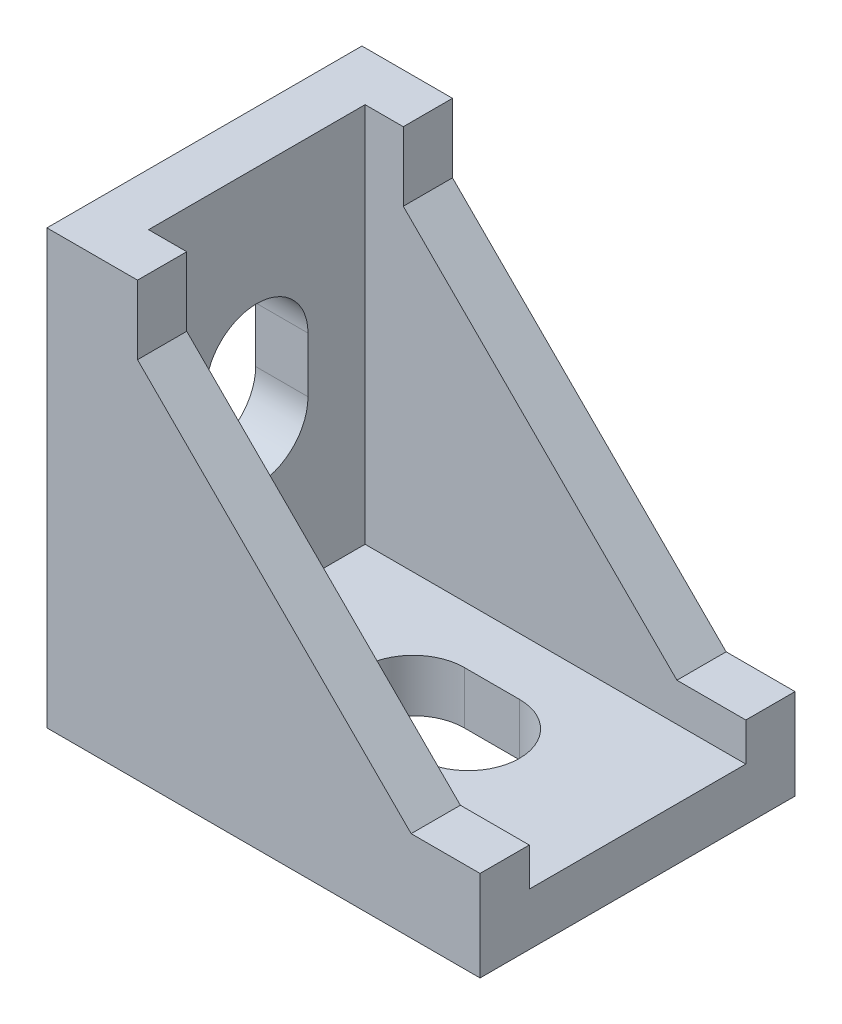
ISO-10303-21;
HEADER;
FILE_DESCRIPTION(('STEP AP214'),'2;1');
FILE_NAME('part.step','',(''),(''),'','','');
FILE_SCHEMA(('AUTOMOTIVE_DESIGN { 1 0 10303 214 1 1 1 1 }'));
ENDSEC;
DATA;
#1=APPLICATION_CONTEXT('core data for automotive mechanical design processes');
#2=APPLICATION_PROTOCOL_DEFINITION('international standard','automotive_design',2000,#1);
#3=PRODUCT_CONTEXT('',#1,'mechanical');
#4=PRODUCT('Part','Part','',(#3));
#5=PRODUCT_RELATED_PRODUCT_CATEGORY('part','',(#4));
#6=PRODUCT_DEFINITION_FORMATION('','',#4);
#7=PRODUCT_DEFINITION_CONTEXT('part definition',#1,'design');
#8=PRODUCT_DEFINITION('design','',#6,#7);
#9=PRODUCT_DEFINITION_SHAPE('','',#8);
#10=(LENGTH_UNIT() NAMED_UNIT(*) SI_UNIT(.MILLI.,.METRE.));
#11=(NAMED_UNIT(*) PLANE_ANGLE_UNIT() SI_UNIT($,.RADIAN.));
#12=(NAMED_UNIT(*) SI_UNIT($,.STERADIAN.) SOLID_ANGLE_UNIT());
#13=UNCERTAINTY_MEASURE_WITH_UNIT(LENGTH_MEASURE(1.E-05),#10,'distance_accuracy_value','');
#14=(GEOMETRIC_REPRESENTATION_CONTEXT(3) GLOBAL_UNCERTAINTY_ASSIGNED_CONTEXT((#13)) GLOBAL_UNIT_ASSIGNED_CONTEXT((#10,
#11,#12)) REPRESENTATION_CONTEXT('',''));
#15=CARTESIAN_POINT('',(0.,0.,0.));
#16=DIRECTION('',(0.,0.,1.));
#17=DIRECTION('',(1.,0.,0.));
#18=AXIS2_PLACEMENT_3D('',#15,#16,#17);
#19=CARTESIAN_POINT('',(5.842,27.94,-20.32));
#20=DIRECTION('',(1.,0.,0.));
#21=DIRECTION('',(0.,1.,0.));
#22=AXIS2_PLACEMENT_3D('',#19,#20,#21);
#23=PLANE('',#22);
#24=DIRECTION('',(0.,-1.,0.));
#25=VECTOR('',#24,1.);
#26=CARTESIAN_POINT('',(5.842,27.94,-3.175));
#27=LINE('',#26,#25);
#28=CARTESIAN_POINT('',(5.842,27.94,-3.175));
#29=VERTEX_POINT('',#28);
#30=CARTESIAN_POINT('',(5.842,23.495,-3.175));
#31=VERTEX_POINT('',#30);
#32=EDGE_CURVE('E277',#29,#31,#27,.T.);
#33=ORIENTED_EDGE('',*,*,#32,.F.);
#34=DIRECTION('',(0.,0.,1.));
#35=VECTOR('',#34,1.);
#36=CARTESIAN_POINT('',(5.842,27.94,-20.32));
#37=LINE('',#36,#35);
#38=CARTESIAN_POINT('',(5.842,27.94,0.));
#39=VERTEX_POINT('',#38);
#40=EDGE_CURVE('E238',#29,#39,#37,.T.);
#41=ORIENTED_EDGE('',*,*,#40,.T.);
#42=DIRECTION('',(0.,1.,0.));
#43=VECTOR('',#42,1.);
#44=CARTESIAN_POINT('',(5.842,27.94,0.));
#45=LINE('',#44,#43);
#46=CARTESIAN_POINT('',(5.842,23.495,0.));
#47=VERTEX_POINT('',#46);
#48=EDGE_CURVE('E257',#47,#39,#45,.T.);
#49=ORIENTED_EDGE('',*,*,#48,.F.);
#50=DIRECTION('',(0.,0.,1.));
#51=VECTOR('',#50,1.);
#52=CARTESIAN_POINT('',(5.842,23.495,-20.32));
#53=LINE('',#52,#51);
#54=EDGE_CURVE('E233',#31,#47,#53,.T.);
#55=ORIENTED_EDGE('',*,*,#54,.F.);
#56=EDGE_LOOP('',(#33,#41,#49,#55));
#57=FACE_BOUND('',#56,.T.);
#58=ADVANCED_FACE('F45',(#57),#23,.T.);
#59=CARTESIAN_POINT('',(5.842,23.495,-20.32));
#60=DIRECTION('',(0.707106781186548,0.707106781186548,0.));
#61=DIRECTION('',(-0.707106781186548,0.707106781186548,0.));
#62=AXIS2_PLACEMENT_3D('',#59,#60,#61);
#63=PLANE('',#62);
#64=DIRECTION('',(0.707106781186548,-0.707106781186548,0.));
#65=VECTOR('',#64,1.);
#66=CARTESIAN_POINT('',(5.842,23.495,-3.175));
#67=LINE('',#66,#65);
#68=CARTESIAN_POINT('',(23.495,5.842,-3.175));
#69=VERTEX_POINT('',#68);
#70=EDGE_CURVE('E306',#31,#69,#67,.T.);
#71=ORIENTED_EDGE('',*,*,#70,.F.);
#72=ORIENTED_EDGE('',*,*,#54,.T.);
#73=DIRECTION('',(-0.707106781186548,0.707106781186548,0.));
#74=VECTOR('',#73,1.);
#75=CARTESIAN_POINT('',(5.842,23.495,0.));
#76=LINE('',#75,#74);
#77=CARTESIAN_POINT('',(23.495,5.842,0.));
#78=VERTEX_POINT('',#77);
#79=EDGE_CURVE('E261',#78,#47,#76,.T.);
#80=ORIENTED_EDGE('',*,*,#79,.F.);
#81=DIRECTION('',(0.,0.,1.));
#82=VECTOR('',#81,1.);
#83=CARTESIAN_POINT('',(23.495,5.842,-20.32));
#84=LINE('',#83,#82);
#85=EDGE_CURVE('E228',#69,#78,#84,.T.);
#86=ORIENTED_EDGE('',*,*,#85,.F.);
#87=EDGE_LOOP('',(#71,#72,#80,#86));
#88=FACE_BOUND('',#87,.T.);
#89=ADVANCED_FACE('F440',(#88),#63,.T.);
#90=CARTESIAN_POINT('',(23.495,5.842,-20.32));
#91=DIRECTION('',(0.,1.,0.));
#92=DIRECTION('',(-1.,0.,0.));
#93=AXIS2_PLACEMENT_3D('',#90,#91,#92);
#94=PLANE('',#93);
#95=DIRECTION('',(1.,0.,0.));
#96=VECTOR('',#95,1.);
#97=CARTESIAN_POINT('',(23.495,5.842,-3.175));
#98=LINE('',#97,#96);
#99=CARTESIAN_POINT('',(27.94,5.842,-3.175));
#100=VERTEX_POINT('',#99);
#101=EDGE_CURVE('E309',#69,#100,#98,.T.);
#102=ORIENTED_EDGE('',*,*,#101,.F.);
#103=ORIENTED_EDGE('',*,*,#85,.T.);
#104=DIRECTION('',(-1.,0.,0.));
#105=VECTOR('',#104,1.);
#106=CARTESIAN_POINT('',(23.495,5.842,0.));
#107=LINE('',#106,#105);
#108=CARTESIAN_POINT('',(27.94,5.842,0.));
#109=VERTEX_POINT('',#108);
#110=EDGE_CURVE('E265',#109,#78,#107,.T.);
#111=ORIENTED_EDGE('',*,*,#110,.F.);
#112=DIRECTION('',(0.,0.,1.));
#113=VECTOR('',#112,1.);
#114=CARTESIAN_POINT('',(27.94,5.842,-20.32));
#115=LINE('',#114,#113);
#116=EDGE_CURVE('E222',#100,#109,#115,.T.);
#117=ORIENTED_EDGE('',*,*,#116,.F.);
#118=EDGE_LOOP('',(#102,#103,#111,#117));
#119=FACE_BOUND('',#118,.T.);
#120=ADVANCED_FACE('F447',(#119),#94,.T.);
#121=CARTESIAN_POINT('',(27.94,0.,-20.32));
#122=DIRECTION('',(0.,-1.,0.));
#123=DIRECTION('',(1.,0.,0.));
#124=AXIS2_PLACEMENT_3D('',#121,#122,#123);
#125=PLANE('',#124);
#126=CARTESIAN_POINT('',(13.462,0.,-10.16));
#127=DIRECTION('',(0.,1.,0.));
#128=DIRECTION('',(-1.,0.,0.));
#129=AXIS2_PLACEMENT_3D('',#126,#127,#128);
#130=CIRCLE('',#129,3.302);
#131=CARTESIAN_POINT('',(13.462,0.,-13.462));
#132=VERTEX_POINT('',#131);
#133=CARTESIAN_POINT('',(13.462,0.,-6.858));
#134=VERTEX_POINT('',#133);
#135=EDGE_CURVE('E378',#132,#134,#130,.T.);
#136=ORIENTED_EDGE('',*,*,#135,.T.);
#137=DIRECTION('',(1.,0.,0.));
#138=VECTOR('',#137,1.);
#139=CARTESIAN_POINT('',(13.462,0.,-6.858));
#140=LINE('',#139,#138);
#141=CARTESIAN_POINT('',(17.018,0.,-6.858));
#142=VERTEX_POINT('',#141);
#143=EDGE_CURVE('E397',#134,#142,#140,.T.);
#144=ORIENTED_EDGE('',*,*,#143,.T.);
#145=CARTESIAN_POINT('',(17.018,0.,-10.16));
#146=DIRECTION('',(0.,1.,0.));
#147=DIRECTION('',(-1.,0.,0.));
#148=AXIS2_PLACEMENT_3D('',#145,#146,#147);
#149=CIRCLE('',#148,3.302);
#150=CARTESIAN_POINT('',(17.018,0.,-13.462));
#151=VERTEX_POINT('',#150);
#152=EDGE_CURVE('E393',#142,#151,#149,.T.);
#153=ORIENTED_EDGE('',*,*,#152,.T.);
#154=DIRECTION('',(-1.,0.,0.));
#155=VECTOR('',#154,1.);
#156=CARTESIAN_POINT('',(13.462,0.,-13.462));
#157=LINE('',#156,#155);
#158=EDGE_CURVE('E366',#151,#132,#157,.T.);
#159=ORIENTED_EDGE('',*,*,#158,.T.);
#160=EDGE_LOOP('',(#136,#144,#153,#159));
#161=FACE_BOUND('',#160,.T.);
#162=DIRECTION('',(1.,0.,0.));
#163=VECTOR('',#162,1.);
#164=CARTESIAN_POINT('',(27.94,0.,0.));
#165=LINE('',#164,#163);
#166=CARTESIAN_POINT('',(0.,0.,0.));
#167=VERTEX_POINT('',#166);
#168=CARTESIAN_POINT('',(27.94,0.,0.));
#169=VERTEX_POINT('',#168);
#170=EDGE_CURVE('E273',#167,#169,#165,.T.);
#171=ORIENTED_EDGE('',*,*,#170,.F.);
#172=DIRECTION('',(0.,0.,1.));
#173=VECTOR('',#172,1.);
#174=CARTESIAN_POINT('',(0.,0.,-20.32));
#175=LINE('',#174,#173);
#176=CARTESIAN_POINT('',(0.,0.,-20.32));
#177=VERTEX_POINT('',#176);
#178=EDGE_CURVE('E198',#177,#167,#175,.T.);
#179=ORIENTED_EDGE('',*,*,#178,.F.);
#180=DIRECTION('',(1.,0.,0.));
#181=VECTOR('',#180,1.);
#182=CARTESIAN_POINT('',(27.94,0.,-20.32));
#183=LINE('',#182,#181);
#184=CARTESIAN_POINT('',(27.94,0.,-20.32));
#185=VERTEX_POINT('',#184);
#186=EDGE_CURVE('E252',#177,#185,#183,.T.);
#187=ORIENTED_EDGE('',*,*,#186,.T.);
#188=DIRECTION('',(0.,0.,1.));
#189=VECTOR('',#188,1.);
#190=CARTESIAN_POINT('',(27.94,0.,-20.32));
#191=LINE('',#190,#189);
#192=EDGE_CURVE('E219',#185,#169,#191,.T.);
#193=ORIENTED_EDGE('',*,*,#192,.T.);
#194=EDGE_LOOP('',(#171,#179,#187,#193));
#195=FACE_BOUND('',#194,.T.);
#196=ADVANCED_FACE('F47',(#161,#195),#125,.T.);
#197=CARTESIAN_POINT('',(0.,0.,-20.32));
#198=DIRECTION('',(-1.,0.,0.));
#199=DIRECTION('',(0.,0.,1.));
#200=AXIS2_PLACEMENT_3D('',#197,#198,#199);
#201=PLANE('',#200);
#202=CARTESIAN_POINT('',(0.,13.462,-10.16));
#203=DIRECTION('',(-1.,0.,0.));
#204=DIRECTION('',(0.,0.,1.));
#205=AXIS2_PLACEMENT_3D('',#202,#203,#204);
#206=CIRCLE('',#205,3.302);
#207=CARTESIAN_POINT('',(0.,13.462,-13.462));
#208=VERTEX_POINT('',#207);
#209=CARTESIAN_POINT('',(0.,13.4619999999997,-6.858));
#210=VERTEX_POINT('',#209);
#211=EDGE_CURVE('E205',#208,#210,#206,.T.);
#212=ORIENTED_EDGE('',*,*,#211,.F.);
#213=DIRECTION('',(0.,-1.,0.));
#214=VECTOR('',#213,1.);
#215=CARTESIAN_POINT('',(0.,0.,-13.462));
#216=LINE('',#215,#214);
#217=CARTESIAN_POINT('',(0.,17.018,-13.462));
#218=VERTEX_POINT('',#217);
#219=EDGE_CURVE('E406',#218,#208,#216,.T.);
#220=ORIENTED_EDGE('',*,*,#219,.F.);
#221=CARTESIAN_POINT('',(0.,17.018,-10.16));
#222=DIRECTION('',(-1.,0.,0.));
#223=DIRECTION('',(0.,0.,1.));
#224=AXIS2_PLACEMENT_3D('',#221,#222,#223);
#225=CIRCLE('',#224,3.302);
#226=CARTESIAN_POINT('',(0.,17.018,-6.858));
#227=VERTEX_POINT('',#226);
#228=EDGE_CURVE('E409',#227,#218,#225,.T.);
#229=ORIENTED_EDGE('',*,*,#228,.F.);
#230=DIRECTION('',(0.,1.,0.));
#231=VECTOR('',#230,1.);
#232=CARTESIAN_POINT('',(0.,0.,-6.85799999999999));
#233=LINE('',#232,#231);
#234=EDGE_CURVE('E412',#210,#227,#233,.T.);
#235=ORIENTED_EDGE('',*,*,#234,.F.);
#236=EDGE_LOOP('',(#212,#220,#229,#235));
#237=FACE_BOUND('',#236,.T.);
#238=DIRECTION('',(0.,-1.,0.));
#239=VECTOR('',#238,1.);
#240=CARTESIAN_POINT('',(0.,0.,0.));
#241=LINE('',#240,#239);
#242=CARTESIAN_POINT('',(0.,27.94,0.));
#243=VERTEX_POINT('',#242);
#244=EDGE_CURVE('E248',#243,#167,#241,.T.);
#245=ORIENTED_EDGE('',*,*,#244,.F.);
#246=DIRECTION('',(0.,0.,1.));
#247=VECTOR('',#246,1.);
#248=CARTESIAN_POINT('',(0.,27.94,-20.32));
#249=LINE('',#248,#247);
#250=CARTESIAN_POINT('',(0.,27.94,-20.32));
#251=VERTEX_POINT('',#250);
#252=EDGE_CURVE('E243',#251,#243,#249,.T.);
#253=ORIENTED_EDGE('',*,*,#252,.F.);
#254=DIRECTION('',(0.,-1.,0.));
#255=VECTOR('',#254,1.);
#256=CARTESIAN_POINT('',(0.,0.,-20.32));
#257=LINE('',#256,#255);
#258=EDGE_CURVE('E223',#251,#177,#257,.T.);
#259=ORIENTED_EDGE('',*,*,#258,.T.);
#260=ORIENTED_EDGE('',*,*,#178,.T.);
#261=EDGE_LOOP('',(#245,#253,#259,#260));
#262=FACE_BOUND('',#261,.T.);
#263=ADVANCED_FACE('F424',(#237,#262),#201,.T.);
#264=CARTESIAN_POINT('',(0.,27.94,-20.32));
#265=DIRECTION('',(0.,1.,0.));
#266=DIRECTION('',(0.,0.,1.));
#267=AXIS2_PLACEMENT_3D('',#264,#265,#266);
#268=PLANE('',#267);
#269=DIRECTION('',(1.,0.,0.));
#270=VECTOR('',#269,1.);
#271=CARTESIAN_POINT('',(3.3782,27.94,-3.175));
#272=LINE('',#271,#270);
#273=CARTESIAN_POINT('',(3.3782,27.94,-3.175));
#274=VERTEX_POINT('',#273);
#275=EDGE_CURVE('E355',#274,#29,#272,.T.);
#276=ORIENTED_EDGE('',*,*,#275,.F.);
#277=DIRECTION('',(0.,0.,1.));
#278=VECTOR('',#277,1.);
#279=CARTESIAN_POINT('',(3.3782,27.94,-17.145));
#280=LINE('',#279,#278);
#281=CARTESIAN_POINT('',(3.3782,27.94,-17.145));
#282=VERTEX_POINT('',#281);
#283=EDGE_CURVE('E351',#282,#274,#280,.T.);
#284=ORIENTED_EDGE('',*,*,#283,.F.);
#285=DIRECTION('',(-1.,0.,0.));
#286=VECTOR('',#285,1.);
#287=CARTESIAN_POINT('',(3.3782,27.94,-17.145));
#288=LINE('',#287,#286);
#289=CARTESIAN_POINT('',(5.842,27.94,-17.145));
#290=VERTEX_POINT('',#289);
#291=EDGE_CURVE('E350',#290,#282,#288,.T.);
#292=ORIENTED_EDGE('',*,*,#291,.F.);
#293=CARTESIAN_POINT('',(5.842,27.94,-20.32));
#294=VERTEX_POINT('',#293);
#295=EDGE_CURVE('E239',#294,#290,#37,.T.);
#296=ORIENTED_EDGE('',*,*,#295,.F.);
#297=DIRECTION('',(-1.,0.,0.));
#298=VECTOR('',#297,1.);
#299=CARTESIAN_POINT('',(0.,27.94,-20.32));
#300=LINE('',#299,#298);
#301=EDGE_CURVE('E281',#294,#251,#300,.T.);
#302=ORIENTED_EDGE('',*,*,#301,.T.);
#303=ORIENTED_EDGE('',*,*,#252,.T.);
#304=DIRECTION('',(-1.,0.,0.));
#305=VECTOR('',#304,1.);
#306=CARTESIAN_POINT('',(0.,27.94,0.));
#307=LINE('',#306,#305);
#308=EDGE_CURVE('E253',#39,#243,#307,.T.);
#309=ORIENTED_EDGE('',*,*,#308,.F.);
#310=ORIENTED_EDGE('',*,*,#40,.F.);
#311=EDGE_LOOP('',(#276,#284,#292,#296,#302,#303,#309,#310));
#312=FACE_BOUND('',#311,.T.);
#313=ADVANCED_FACE('F454',(#312),#268,.T.);
#314=DIRECTION('',(0.,1.,0.));
#315=VECTOR('',#314,1.);
#316=CARTESIAN_POINT('',(5.842,27.94,-17.145));
#317=LINE('',#316,#315);
#318=CARTESIAN_POINT('',(5.842,23.495,-17.145));
#319=VERTEX_POINT('',#318);
#320=EDGE_CURVE('E312',#319,#290,#317,.T.);
#321=ORIENTED_EDGE('',*,*,#320,.F.);
#322=CARTESIAN_POINT('',(5.842,23.495,-20.32));
#323=VERTEX_POINT('',#322);
#324=EDGE_CURVE('E234',#323,#319,#53,.T.);
#325=ORIENTED_EDGE('',*,*,#324,.F.);
#326=DIRECTION('',(0.,1.,0.));
#327=VECTOR('',#326,1.);
#328=CARTESIAN_POINT('',(5.842,27.94,-20.32));
#329=LINE('',#328,#327);
#330=EDGE_CURVE('E285',#323,#294,#329,.T.);
#331=ORIENTED_EDGE('',*,*,#330,.T.);
#332=ORIENTED_EDGE('',*,*,#295,.T.);
#333=EDGE_LOOP('',(#321,#325,#331,#332));
#334=FACE_BOUND('',#333,.T.);
#335=ADVANCED_FACE('F443',(#334),#23,.T.);
#336=DIRECTION('',(-0.707106781186548,0.707106781186548,0.));
#337=VECTOR('',#336,1.);
#338=CARTESIAN_POINT('',(5.842,23.495,-17.145));
#339=LINE('',#338,#337);
#340=CARTESIAN_POINT('',(23.495,5.842,-17.145));
#341=VERTEX_POINT('',#340);
#342=EDGE_CURVE('E315',#341,#319,#339,.T.);
#343=ORIENTED_EDGE('',*,*,#342,.F.);
#344=CARTESIAN_POINT('',(23.495,5.842,-20.32));
#345=VERTEX_POINT('',#344);
#346=EDGE_CURVE('E229',#345,#341,#84,.T.);
#347=ORIENTED_EDGE('',*,*,#346,.F.);
#348=DIRECTION('',(-0.707106781186548,0.707106781186548,0.));
#349=VECTOR('',#348,1.);
#350=CARTESIAN_POINT('',(5.842,23.495,-20.32));
#351=LINE('',#350,#349);
#352=EDGE_CURVE('E289',#345,#323,#351,.T.);
#353=ORIENTED_EDGE('',*,*,#352,.T.);
#354=ORIENTED_EDGE('',*,*,#324,.T.);
#355=EDGE_LOOP('',(#343,#347,#353,#354));
#356=FACE_BOUND('',#355,.T.);
#357=ADVANCED_FACE('F450',(#356),#63,.T.);
#358=DIRECTION('',(-1.,0.,0.));
#359=VECTOR('',#358,1.);
#360=CARTESIAN_POINT('',(23.495,5.842,-17.145));
#361=LINE('',#360,#359);
#362=CARTESIAN_POINT('',(27.94,5.842,-17.145));
#363=VERTEX_POINT('',#362);
#364=EDGE_CURVE('E318',#363,#341,#361,.T.);
#365=ORIENTED_EDGE('',*,*,#364,.F.);
#366=CARTESIAN_POINT('',(27.94,5.842,-20.32));
#367=VERTEX_POINT('',#366);
#368=EDGE_CURVE('E224',#367,#363,#115,.T.);
#369=ORIENTED_EDGE('',*,*,#368,.F.);
#370=DIRECTION('',(-1.,0.,0.));
#371=VECTOR('',#370,1.);
#372=CARTESIAN_POINT('',(23.495,5.842,-20.32));
#373=LINE('',#372,#371);
#374=EDGE_CURVE('E293',#367,#345,#373,.T.);
#375=ORIENTED_EDGE('',*,*,#374,.T.);
#376=ORIENTED_EDGE('',*,*,#346,.T.);
#377=EDGE_LOOP('',(#365,#369,#375,#376));
#378=FACE_BOUND('',#377,.T.);
#379=ADVANCED_FACE('F460',(#378),#94,.T.);
#380=CARTESIAN_POINT('',(27.94,5.842,-20.32));
#381=DIRECTION('',(1.,0.,0.));
#382=DIRECTION('',(0.,0.,-1.));
#383=AXIS2_PLACEMENT_3D('',#380,#381,#382);
#384=PLANE('',#383);
#385=DIRECTION('',(0.,1.,0.));
#386=VECTOR('',#385,1.);
#387=CARTESIAN_POINT('',(27.94,-28.2567322817059,-3.175));
#388=LINE('',#387,#386);
#389=CARTESIAN_POINT('',(27.94,3.37819999999999,-3.175));
#390=VERTEX_POINT('',#389);
#391=EDGE_CURVE('E325',#390,#100,#388,.T.);
#392=ORIENTED_EDGE('',*,*,#391,.T.);
#393=ORIENTED_EDGE('',*,*,#116,.T.);
#394=DIRECTION('',(0.,1.,0.));
#395=VECTOR('',#394,1.);
#396=CARTESIAN_POINT('',(27.94,5.842,0.));
#397=LINE('',#396,#395);
#398=EDGE_CURVE('E269',#169,#109,#397,.T.);
#399=ORIENTED_EDGE('',*,*,#398,.F.);
#400=ORIENTED_EDGE('',*,*,#192,.F.);
#401=DIRECTION('',(0.,1.,0.));
#402=VECTOR('',#401,1.);
#403=CARTESIAN_POINT('',(27.94,5.842,-20.32));
#404=LINE('',#403,#402);
#405=EDGE_CURVE('E297',#185,#367,#404,.T.);
#406=ORIENTED_EDGE('',*,*,#405,.T.);
#407=ORIENTED_EDGE('',*,*,#368,.T.);
#408=DIRECTION('',(0.,1.,0.));
#409=VECTOR('',#408,1.);
#410=CARTESIAN_POINT('',(27.94,-28.2567322817059,-17.145));
#411=LINE('',#410,#409);
#412=CARTESIAN_POINT('',(27.94,3.37819999999999,-17.145));
#413=VERTEX_POINT('',#412);
#414=EDGE_CURVE('E331',#413,#363,#411,.T.);
#415=ORIENTED_EDGE('',*,*,#414,.F.);
#416=DIRECTION('',(0.,0.,-1.));
#417=VECTOR('',#416,1.);
#418=CARTESIAN_POINT('',(27.94,3.37819999999999,-17.145));
#419=LINE('',#418,#417);
#420=EDGE_CURVE('E329',#390,#413,#419,.T.);
#421=ORIENTED_EDGE('',*,*,#420,.F.);
#422=EDGE_LOOP('',(#392,#393,#399,#400,#406,#407,#415,#421));
#423=FACE_BOUND('',#422,.T.);
#424=ADVANCED_FACE('F479',(#423),#384,.T.);
#425=CARTESIAN_POINT('',(0.,0.,-20.32));
#426=DIRECTION('',(0.,0.,-1.));
#427=DIRECTION('',(-1.,0.,0.));
#428=AXIS2_PLACEMENT_3D('',#425,#426,#427);
#429=PLANE('',#428);
#430=ORIENTED_EDGE('',*,*,#186,.F.);
#431=ORIENTED_EDGE('',*,*,#258,.F.);
#432=ORIENTED_EDGE('',*,*,#301,.F.);
#433=ORIENTED_EDGE('',*,*,#330,.F.);
#434=ORIENTED_EDGE('',*,*,#352,.F.);
#435=ORIENTED_EDGE('',*,*,#374,.F.);
#436=ORIENTED_EDGE('',*,*,#405,.F.);
#437=EDGE_LOOP('',(#430,#431,#432,#433,#434,#435,#436));
#438=FACE_BOUND('',#437,.T.);
#439=ADVANCED_FACE('F472',(#438),#429,.T.);
#440=CARTESIAN_POINT('',(0.,0.,0.));
#441=DIRECTION('',(0.,0.,-1.));
#442=DIRECTION('',(-1.,0.,0.));
#443=AXIS2_PLACEMENT_3D('',#440,#441,#442);
#444=PLANE('',#443);
#445=ORIENTED_EDGE('',*,*,#170,.T.);
#446=ORIENTED_EDGE('',*,*,#398,.T.);
#447=ORIENTED_EDGE('',*,*,#110,.T.);
#448=ORIENTED_EDGE('',*,*,#79,.T.);
#449=ORIENTED_EDGE('',*,*,#48,.T.);
#450=ORIENTED_EDGE('',*,*,#308,.T.);
#451=ORIENTED_EDGE('',*,*,#244,.T.);
#452=EDGE_LOOP('',(#445,#446,#447,#448,#449,#450,#451));
#453=FACE_BOUND('',#452,.T.);
#454=ADVANCED_FACE('F509',(#453),#444,.F.);
#455=CARTESIAN_POINT('',(27.94,3.3782,-20.32));
#456=DIRECTION('',(0.,-1.,0.));
#457=DIRECTION('',(1.,0.,0.));
#458=AXIS2_PLACEMENT_3D('',#455,#456,#457);
#459=PLANE('',#458);
#460=DIRECTION('',(1.,0.,0.));
#461=VECTOR('',#460,1.);
#462=CARTESIAN_POINT('',(13.462,3.3782,-6.858));
#463=LINE('',#462,#461);
#464=CARTESIAN_POINT('',(13.462,3.3782,-6.858));
#465=VERTEX_POINT('',#464);
#466=CARTESIAN_POINT('',(17.018,3.3782,-6.858));
#467=VERTEX_POINT('',#466);
#468=EDGE_CURVE('E383',#465,#467,#463,.T.);
#469=ORIENTED_EDGE('',*,*,#468,.F.);
#470=CARTESIAN_POINT('',(13.462,3.3782,-10.16));
#471=DIRECTION('',(0.,1.,0.));
#472=DIRECTION('',(-1.,0.,0.));
#473=AXIS2_PLACEMENT_3D('',#470,#471,#472);
#474=CIRCLE('',#473,3.302);
#475=CARTESIAN_POINT('',(13.462,3.3782,-13.462));
#476=VERTEX_POINT('',#475);
#477=EDGE_CURVE('E387',#476,#465,#474,.T.);
#478=ORIENTED_EDGE('',*,*,#477,.F.);
#479=DIRECTION('',(-1.,0.,0.));
#480=VECTOR('',#479,1.);
#481=CARTESIAN_POINT('',(13.462,3.3782,-13.462));
#482=LINE('',#481,#480);
#483=CARTESIAN_POINT('',(17.018,3.3782,-13.462));
#484=VERTEX_POINT('',#483);
#485=EDGE_CURVE('E374',#484,#476,#482,.T.);
#486=ORIENTED_EDGE('',*,*,#485,.F.);
#487=CARTESIAN_POINT('',(17.018,3.3782,-10.16));
#488=DIRECTION('',(0.,1.,0.));
#489=DIRECTION('',(-1.,0.,0.));
#490=AXIS2_PLACEMENT_3D('',#487,#488,#489);
#491=CIRCLE('',#490,3.302);
#492=EDGE_CURVE('E379',#467,#484,#491,.T.);
#493=ORIENTED_EDGE('',*,*,#492,.F.);
#494=EDGE_LOOP('',(#469,#478,#486,#493));
#495=FACE_BOUND('',#494,.T.);
#496=DIRECTION('',(0.,0.,1.));
#497=VECTOR('',#496,1.);
#498=CARTESIAN_POINT('',(3.3782,3.37819999999999,-17.145));
#499=LINE('',#498,#497);
#500=CARTESIAN_POINT('',(3.3782,3.37819999999999,-17.145));
#501=VERTEX_POINT('',#500);
#502=CARTESIAN_POINT('',(3.3782,3.37819999999999,-3.175));
#503=VERTEX_POINT('',#502);
#504=EDGE_CURVE('E324',#501,#503,#499,.T.);
#505=ORIENTED_EDGE('',*,*,#504,.T.);
#506=DIRECTION('',(1.,0.,0.));
#507=VECTOR('',#506,1.);
#508=CARTESIAN_POINT('',(3.37820000000001,3.37819999999999,-3.175));
#509=LINE('',#508,#507);
#510=EDGE_CURVE('E330',#503,#390,#509,.T.);
#511=ORIENTED_EDGE('',*,*,#510,.T.);
#512=ORIENTED_EDGE('',*,*,#420,.T.);
#513=DIRECTION('',(-1.,0.,0.));
#514=VECTOR('',#513,1.);
#515=CARTESIAN_POINT('',(3.3782,3.37819999999999,-17.145));
#516=LINE('',#515,#514);
#517=EDGE_CURVE('E334',#413,#501,#516,.T.);
#518=ORIENTED_EDGE('',*,*,#517,.T.);
#519=EDGE_LOOP('',(#505,#511,#512,#518));
#520=FACE_BOUND('',#519,.T.);
#521=ADVANCED_FACE('F494',(#495,#520),#459,.F.);
#522=CARTESIAN_POINT('',(3.3782,-28.2567322817059,-3.175));
#523=DIRECTION('',(0.,0.,1.));
#524=DIRECTION('',(1.,0.,0.));
#525=AXIS2_PLACEMENT_3D('',#522,#523,#524);
#526=PLANE('',#525);
#527=ORIENTED_EDGE('',*,*,#32,.T.);
#528=ORIENTED_EDGE('',*,*,#70,.T.);
#529=ORIENTED_EDGE('',*,*,#101,.T.);
#530=ORIENTED_EDGE('',*,*,#391,.F.);
#531=ORIENTED_EDGE('',*,*,#510,.F.);
#532=DIRECTION('',(0.,1.,0.));
#533=VECTOR('',#532,1.);
#534=CARTESIAN_POINT('',(3.3782,-28.2567322817059,-3.175));
#535=LINE('',#534,#533);
#536=EDGE_CURVE('E321',#503,#274,#535,.T.);
#537=ORIENTED_EDGE('',*,*,#536,.T.);
#538=ORIENTED_EDGE('',*,*,#275,.T.);
#539=EDGE_LOOP('',(#527,#528,#529,#530,#531,#537,#538));
#540=FACE_BOUND('',#539,.T.);
#541=ADVANCED_FACE('F512',(#540),#526,.F.);
#542=CARTESIAN_POINT('',(3.3782,-28.2567322817059,-17.145));
#543=DIRECTION('',(0.,0.,-1.));
#544=DIRECTION('',(-1.,0.,0.));
#545=AXIS2_PLACEMENT_3D('',#542,#543,#544);
#546=PLANE('',#545);
#547=ORIENTED_EDGE('',*,*,#320,.T.);
#548=ORIENTED_EDGE('',*,*,#291,.T.);
#549=DIRECTION('',(0.,1.,0.));
#550=VECTOR('',#549,1.);
#551=CARTESIAN_POINT('',(3.3782,-28.2567322817059,-17.145));
#552=LINE('',#551,#550);
#553=EDGE_CURVE('E335',#501,#282,#552,.T.);
#554=ORIENTED_EDGE('',*,*,#553,.F.);
#555=ORIENTED_EDGE('',*,*,#517,.F.);
#556=ORIENTED_EDGE('',*,*,#414,.T.);
#557=ORIENTED_EDGE('',*,*,#364,.T.);
#558=ORIENTED_EDGE('',*,*,#342,.T.);
#559=EDGE_LOOP('',(#547,#548,#554,#555,#556,#557,#558));
#560=FACE_BOUND('',#559,.T.);
#561=ADVANCED_FACE('F490',(#560),#546,.F.);
#562=CARTESIAN_POINT('',(3.3782,-28.2567322817059,-17.145));
#563=DIRECTION('',(-1.,0.,0.));
#564=DIRECTION('',(0.,0.,1.));
#565=AXIS2_PLACEMENT_3D('',#562,#563,#564);
#566=PLANE('',#565);
#567=DIRECTION('',(0.,-1.,0.));
#568=VECTOR('',#567,1.);
#569=CARTESIAN_POINT('',(3.3782,-28.2567322817059,-13.462));
#570=LINE('',#569,#568);
#571=CARTESIAN_POINT('',(3.3782,17.018,-13.462));
#572=VERTEX_POINT('',#571);
#573=CARTESIAN_POINT('',(3.3782,13.462,-13.462));
#574=VERTEX_POINT('',#573);
#575=EDGE_CURVE('E54',#572,#574,#570,.T.);
#576=ORIENTED_EDGE('',*,*,#575,.T.);
#577=CARTESIAN_POINT('',(3.3782,13.462,-10.16));
#578=DIRECTION('',(-1.,0.,0.));
#579=DIRECTION('',(0.,0.,1.));
#580=AXIS2_PLACEMENT_3D('',#577,#578,#579);
#581=CIRCLE('',#580,3.302);
#582=CARTESIAN_POINT('',(3.3782,13.462,-6.858));
#583=VERTEX_POINT('',#582);
#584=EDGE_CURVE('E12',#574,#583,#581,.T.);
#585=ORIENTED_EDGE('',*,*,#584,.T.);
#586=DIRECTION('',(0.,1.,0.));
#587=VECTOR('',#586,1.);
#588=CARTESIAN_POINT('',(3.3782,-28.2567322817059,-6.85799999999998));
#589=LINE('',#588,#587);
#590=CARTESIAN_POINT('',(3.3782,17.018,-6.858));
#591=VERTEX_POINT('',#590);
#592=EDGE_CURVE('E192',#583,#591,#589,.T.);
#593=ORIENTED_EDGE('',*,*,#592,.T.);
#594=CARTESIAN_POINT('',(3.3782,17.018,-10.16));
#595=DIRECTION('',(-1.,0.,0.));
#596=DIRECTION('',(0.,0.,1.));
#597=AXIS2_PLACEMENT_3D('',#594,#595,#596);
#598=CIRCLE('',#597,3.302);
#599=EDGE_CURVE('E197',#591,#572,#598,.T.);
#600=ORIENTED_EDGE('',*,*,#599,.T.);
#601=EDGE_LOOP('',(#576,#585,#593,#600));
#602=FACE_BOUND('',#601,.T.);
#603=ORIENTED_EDGE('',*,*,#553,.T.);
#604=ORIENTED_EDGE('',*,*,#283,.T.);
#605=ORIENTED_EDGE('',*,*,#536,.F.);
#606=ORIENTED_EDGE('',*,*,#504,.F.);
#607=EDGE_LOOP('',(#603,#604,#605,#606));
#608=FACE_BOUND('',#607,.T.);
#609=ADVANCED_FACE('F210',(#602,#608),#566,.F.);
#610=CARTESIAN_POINT('',(13.462,0.,-10.16));
#611=DIRECTION('',(0.,1.,0.));
#612=DIRECTION('',(-1.,0.,0.));
#613=AXIS2_PLACEMENT_3D('',#610,#611,#612);
#614=CYLINDRICAL_SURFACE('',#613,3.302);
#615=ORIENTED_EDGE('',*,*,#477,.T.);
#616=DIRECTION('',(0.,1.,0.));
#617=VECTOR('',#616,1.);
#618=CARTESIAN_POINT('',(13.462,0.,-6.858));
#619=LINE('',#618,#617);
#620=EDGE_CURVE('E361',#134,#465,#619,.T.);
#621=ORIENTED_EDGE('',*,*,#620,.F.);
#622=ORIENTED_EDGE('',*,*,#135,.F.);
#623=DIRECTION('',(0.,1.,0.));
#624=VECTOR('',#623,1.);
#625=CARTESIAN_POINT('',(13.462,0.,-13.462));
#626=LINE('',#625,#624);
#627=EDGE_CURVE('E356',#132,#476,#626,.T.);
#628=ORIENTED_EDGE('',*,*,#627,.T.);
#629=EDGE_LOOP('',(#615,#621,#622,#628));
#630=FACE_BOUND('',#629,.T.);
#631=ADVANCED_FACE('F541',(#630),#614,.F.);
#632=CARTESIAN_POINT('',(13.462,0.,-13.462));
#633=DIRECTION('',(0.,0.,-1.));
#634=DIRECTION('',(-1.,0.,0.));
#635=AXIS2_PLACEMENT_3D('',#632,#633,#634);
#636=PLANE('',#635);
#637=ORIENTED_EDGE('',*,*,#485,.T.);
#638=ORIENTED_EDGE('',*,*,#627,.F.);
#639=ORIENTED_EDGE('',*,*,#158,.F.);
#640=DIRECTION('',(0.,1.,0.));
#641=VECTOR('',#640,1.);
#642=CARTESIAN_POINT('',(17.018,0.,-13.462));
#643=LINE('',#642,#641);
#644=EDGE_CURVE('E369',#151,#484,#643,.T.);
#645=ORIENTED_EDGE('',*,*,#644,.T.);
#646=EDGE_LOOP('',(#637,#638,#639,#645));
#647=FACE_BOUND('',#646,.T.);
#648=ADVANCED_FACE('F551',(#647),#636,.F.);
#649=CARTESIAN_POINT('',(17.018,0.,-10.16));
#650=DIRECTION('',(0.,1.,0.));
#651=DIRECTION('',(-1.,0.,0.));
#652=AXIS2_PLACEMENT_3D('',#649,#650,#651);
#653=CYLINDRICAL_SURFACE('',#652,3.302);
#654=ORIENTED_EDGE('',*,*,#492,.T.);
#655=ORIENTED_EDGE('',*,*,#644,.F.);
#656=ORIENTED_EDGE('',*,*,#152,.F.);
#657=DIRECTION('',(0.,1.,0.));
#658=VECTOR('',#657,1.);
#659=CARTESIAN_POINT('',(17.018,0.,-6.858));
#660=LINE('',#659,#658);
#661=EDGE_CURVE('E365',#142,#467,#660,.T.);
#662=ORIENTED_EDGE('',*,*,#661,.T.);
#663=EDGE_LOOP('',(#654,#655,#656,#662));
#664=FACE_BOUND('',#663,.T.);
#665=ADVANCED_FACE('F548',(#664),#653,.F.);
#666=CARTESIAN_POINT('',(13.462,0.,-6.858));
#667=DIRECTION('',(0.,0.,1.));
#668=DIRECTION('',(1.,0.,0.));
#669=AXIS2_PLACEMENT_3D('',#666,#667,#668);
#670=PLANE('',#669);
#671=ORIENTED_EDGE('',*,*,#468,.T.);
#672=ORIENTED_EDGE('',*,*,#661,.F.);
#673=ORIENTED_EDGE('',*,*,#143,.F.);
#674=ORIENTED_EDGE('',*,*,#620,.T.);
#675=EDGE_LOOP('',(#671,#672,#673,#674));
#676=FACE_BOUND('',#675,.T.);
#677=ADVANCED_FACE('F437',(#676),#670,.F.);
#678=CARTESIAN_POINT('',(27.9400000000001,13.4619999999997,-10.16));
#679=DIRECTION('',(-1.,0.,0.));
#680=DIRECTION('',(0.,-1.,0.));
#681=AXIS2_PLACEMENT_3D('',#678,#679,#680);
#682=CYLINDRICAL_SURFACE('',#681,3.302);
#683=ORIENTED_EDGE('',*,*,#211,.T.);
#684=DIRECTION('',(-1.,0.,0.));
#685=VECTOR('',#684,1.);
#686=CARTESIAN_POINT('',(27.9400000000001,13.4619999999997,-6.858));
#687=LINE('',#686,#685);
#688=EDGE_CURVE('E61',#583,#210,#687,.T.);
#689=ORIENTED_EDGE('',*,*,#688,.F.);
#690=ORIENTED_EDGE('',*,*,#584,.F.);
#691=DIRECTION('',(-1.,0.,0.));
#692=VECTOR('',#691,1.);
#693=CARTESIAN_POINT('',(27.9400000000001,13.4619999999997,-13.462));
#694=LINE('',#693,#692);
#695=EDGE_CURVE('E414',#574,#208,#694,.T.);
#696=ORIENTED_EDGE('',*,*,#695,.T.);
#697=EDGE_LOOP('',(#683,#689,#690,#696));
#698=FACE_BOUND('',#697,.T.);
#699=ADVANCED_FACE('F201',(#698),#682,.F.);
#700=CARTESIAN_POINT('',(27.9400000000001,13.4619999999997,-13.462));
#701=DIRECTION('',(0.,0.,-1.));
#702=DIRECTION('',(0.,1.,0.));
#703=AXIS2_PLACEMENT_3D('',#700,#701,#702);
#704=PLANE('',#703);
#705=ORIENTED_EDGE('',*,*,#219,.T.);
#706=ORIENTED_EDGE('',*,*,#695,.F.);
#707=ORIENTED_EDGE('',*,*,#575,.F.);
#708=DIRECTION('',(-1.,0.,0.));
#709=VECTOR('',#708,1.);
#710=CARTESIAN_POINT('',(27.9400000000002,17.0179999999997,-13.462));
#711=LINE('',#710,#709);
#712=EDGE_CURVE('E418',#572,#218,#711,.T.);
#713=ORIENTED_EDGE('',*,*,#712,.T.);
#714=EDGE_LOOP('',(#705,#706,#707,#713));
#715=FACE_BOUND('',#714,.T.);
#716=ADVANCED_FACE('F429',(#715),#704,.F.);
#717=CARTESIAN_POINT('',(27.9400000000002,17.0179999999997,-10.16));
#718=DIRECTION('',(-1.,0.,0.));
#719=DIRECTION('',(0.,-1.,0.));
#720=AXIS2_PLACEMENT_3D('',#717,#718,#719);
#721=CYLINDRICAL_SURFACE('',#720,3.302);
#722=ORIENTED_EDGE('',*,*,#228,.T.);
#723=ORIENTED_EDGE('',*,*,#712,.F.);
#724=ORIENTED_EDGE('',*,*,#599,.F.);
#725=DIRECTION('',(-1.,0.,0.));
#726=VECTOR('',#725,1.);
#727=CARTESIAN_POINT('',(27.9400000000002,17.0179999999997,-6.858));
#728=LINE('',#727,#726);
#729=EDGE_CURVE('E66',#591,#227,#728,.T.);
#730=ORIENTED_EDGE('',*,*,#729,.T.);
#731=EDGE_LOOP('',(#722,#723,#724,#730));
#732=FACE_BOUND('',#731,.T.);
#733=ADVANCED_FACE('F428',(#732),#721,.F.);
#734=CARTESIAN_POINT('',(27.9400000000001,13.4619999999997,-6.858));
#735=DIRECTION('',(0.,0.,1.));
#736=DIRECTION('',(0.,-1.,0.));
#737=AXIS2_PLACEMENT_3D('',#734,#735,#736);
#738=PLANE('',#737);
#739=ORIENTED_EDGE('',*,*,#234,.T.);
#740=ORIENTED_EDGE('',*,*,#729,.F.);
#741=ORIENTED_EDGE('',*,*,#592,.F.);
#742=ORIENTED_EDGE('',*,*,#688,.T.);
#743=EDGE_LOOP('',(#739,#740,#741,#742));
#744=FACE_BOUND('',#743,.T.);
#745=ADVANCED_FACE('F193',(#744),#738,.F.);
#746=CLOSED_SHELL('',(#58,#89,#120,#196,#263,#313,#335,#357,#379,#424,#439,#454,#521,#541,#561,
#609,#631,#648,#665,#677,#699,#716,#733,#745));
#747=MANIFOLD_SOLID_BREP('B2',#746);
#748=ADVANCED_BREP_SHAPE_REPRESENTATION('',(#18,#747),#14);
#749=SHAPE_DEFINITION_REPRESENTATION(#9,#748);
ENDSEC;
END-ISO-10303-21;
